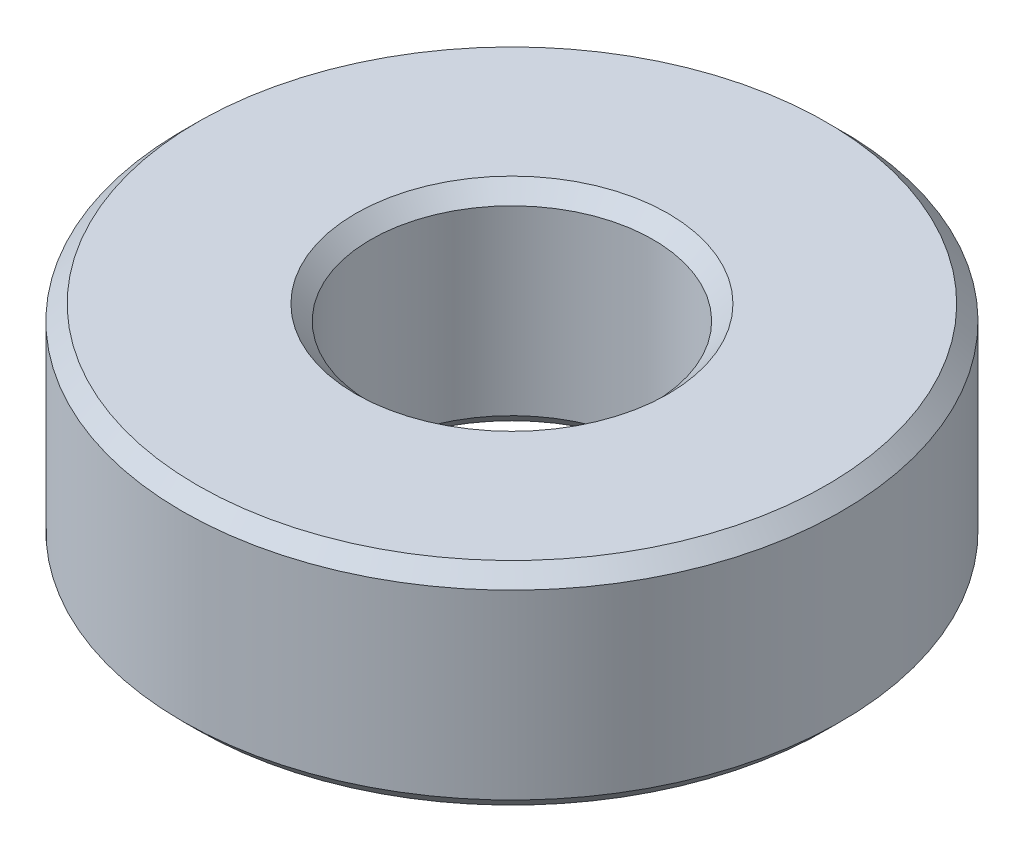
ISO-10303-21;
HEADER;
FILE_DESCRIPTION(('STEP AP214'),'2;1');
FILE_NAME('part.step','',(''),(''),'','','');
FILE_SCHEMA(('AUTOMOTIVE_DESIGN { 1 0 10303 214 1 1 1 1 }'));
ENDSEC;
DATA;
#1=APPLICATION_CONTEXT('core data for automotive mechanical design processes');
#2=APPLICATION_PROTOCOL_DEFINITION('international standard','automotive_design',2000,#1);
#3=PRODUCT_CONTEXT('',#1,'mechanical');
#4=PRODUCT('Part','Part','',(#3));
#5=PRODUCT_RELATED_PRODUCT_CATEGORY('part','',(#4));
#6=PRODUCT_DEFINITION_FORMATION('','',#4);
#7=PRODUCT_DEFINITION_CONTEXT('part definition',#1,'design');
#8=PRODUCT_DEFINITION('design','',#6,#7);
#9=PRODUCT_DEFINITION_SHAPE('','',#8);
#10=(LENGTH_UNIT() NAMED_UNIT(*) SI_UNIT(.MILLI.,.METRE.));
#11=(NAMED_UNIT(*) PLANE_ANGLE_UNIT() SI_UNIT($,.RADIAN.));
#12=(NAMED_UNIT(*) SI_UNIT($,.STERADIAN.) SOLID_ANGLE_UNIT());
#13=UNCERTAINTY_MEASURE_WITH_UNIT(LENGTH_MEASURE(1.E-05),#10,'distance_accuracy_value','');
#14=(GEOMETRIC_REPRESENTATION_CONTEXT(3) GLOBAL_UNCERTAINTY_ASSIGNED_CONTEXT((#13)) GLOBAL_UNIT_ASSIGNED_CONTEXT((#10,
#11,#12)) REPRESENTATION_CONTEXT('',''));
#15=CARTESIAN_POINT('',(0.,0.,0.));
#16=DIRECTION('',(0.,0.,1.));
#17=DIRECTION('',(1.,0.,0.));
#18=AXIS2_PLACEMENT_3D('',#15,#16,#17);
#19=CARTESIAN_POINT('',(0.,-3.571875,0.));
#20=DIRECTION('',(0.,1.,0.));
#21=DIRECTION('',(1.,0.,0.));
#22=AXIS2_PLACEMENT_3D('',#19,#20,#21);
#23=PLANE('',#22);
#24=CARTESIAN_POINT('',(0.,-3.571875,0.));
#25=DIRECTION('',(0.,1.,0.));
#26=DIRECTION('',(0.,0.,1.));
#27=AXIS2_PLACEMENT_3D('',#24,#25,#26);
#28=CIRCLE('',#27,5.2705);
#29=CARTESIAN_POINT('',(0.,-3.571875,5.2705));
#30=VERTEX_POINT('',#29);
#31=EDGE_CURVE('E10',#30,#30,#28,.T.);
#32=ORIENTED_EDGE('',*,*,#31,.T.);
#33=EDGE_LOOP('',(#32));
#34=FACE_BOUND('',#33,.T.);
#35=CARTESIAN_POINT('',(0.,-3.571875,0.));
#36=DIRECTION('',(0.,-1.,0.));
#37=DIRECTION('',(0.,0.,1.));
#38=AXIS2_PLACEMENT_3D('',#35,#36,#37);
#39=CIRCLE('',#38,10.6045);
#40=CARTESIAN_POINT('',(0.,-3.571875,10.6045));
#41=VERTEX_POINT('',#40);
#42=EDGE_CURVE('E34',#41,#41,#39,.T.);
#43=ORIENTED_EDGE('',*,*,#42,.T.);
#44=EDGE_LOOP('',(#43));
#45=FACE_BOUND('',#44,.T.);
#46=ADVANCED_FACE('F14',(#34,#45),#23,.F.);
#47=CARTESIAN_POINT('',(0.,3.571875,0.));
#48=DIRECTION('',(0.,1.,0.));
#49=DIRECTION('',(1.,0.,0.));
#50=AXIS2_PLACEMENT_3D('',#47,#48,#49);
#51=PLANE('',#50);
#52=CARTESIAN_POINT('',(0.,3.571875,0.));
#53=DIRECTION('',(0.,-1.,0.));
#54=DIRECTION('',(0.,0.,1.));
#55=AXIS2_PLACEMENT_3D('',#52,#53,#54);
#56=CIRCLE('',#55,5.2705);
#57=CARTESIAN_POINT('',(0.,3.571875,5.2705));
#58=VERTEX_POINT('',#57);
#59=EDGE_CURVE('E40',#58,#58,#56,.T.);
#60=ORIENTED_EDGE('',*,*,#59,.T.);
#61=EDGE_LOOP('',(#60));
#62=FACE_BOUND('',#61,.T.);
#63=CARTESIAN_POINT('',(0.,3.571875,0.));
#64=DIRECTION('',(0.,1.,0.));
#65=DIRECTION('',(0.,0.,1.));
#66=AXIS2_PLACEMENT_3D('',#63,#64,#65);
#67=CIRCLE('',#66,10.6045);
#68=CARTESIAN_POINT('',(0.,3.571875,10.6045));
#69=VERTEX_POINT('',#68);
#70=EDGE_CURVE('E57',#69,#69,#67,.T.);
#71=ORIENTED_EDGE('',*,*,#70,.T.);
#72=EDGE_LOOP('',(#71));
#73=FACE_BOUND('',#72,.T.);
#74=ADVANCED_FACE('F16',(#62,#73),#51,.T.);
#75=CARTESIAN_POINT('',(0.,3.571875,0.));
#76=DIRECTION('',(0.,-1.,0.));
#77=DIRECTION('',(0.,0.,-1.));
#78=AXIS2_PLACEMENT_3D('',#75,#76,#77);
#79=CYLINDRICAL_SURFACE('',#78,11.1125);
#80=CARTESIAN_POINT('',(0.,-3.063875,0.));
#81=DIRECTION('',(0.,1.,0.));
#82=DIRECTION('',(0.,0.,1.));
#83=AXIS2_PLACEMENT_3D('',#80,#81,#82);
#84=CIRCLE('',#83,11.1125);
#85=CARTESIAN_POINT('',(0.,-3.063875,11.1125));
#86=VERTEX_POINT('',#85);
#87=EDGE_CURVE('E18',#86,#86,#84,.T.);
#88=ORIENTED_EDGE('',*,*,#87,.T.);
#89=EDGE_LOOP('',(#88));
#90=FACE_BOUND('',#89,.T.);
#91=CARTESIAN_POINT('',(0.,3.063875,0.));
#92=DIRECTION('',(0.,-1.,0.));
#93=DIRECTION('',(0.,0.,1.));
#94=AXIS2_PLACEMENT_3D('',#91,#92,#93);
#95=CIRCLE('',#94,11.1125);
#96=CARTESIAN_POINT('',(0.,3.063875,11.1125));
#97=VERTEX_POINT('',#96);
#98=EDGE_CURVE('E47',#97,#97,#95,.T.);
#99=ORIENTED_EDGE('',*,*,#98,.T.);
#100=EDGE_LOOP('',(#99));
#101=FACE_BOUND('',#100,.T.);
#102=ADVANCED_FACE('F81',(#90,#101),#79,.T.);
#103=CARTESIAN_POINT('',(0.,3.571875,0.));
#104=DIRECTION('',(0.,-1.,0.));
#105=DIRECTION('',(0.,0.,-1.));
#106=AXIS2_PLACEMENT_3D('',#103,#104,#105);
#107=CYLINDRICAL_SURFACE('',#106,4.7625);
#108=CARTESIAN_POINT('',(0.,-3.063875,0.));
#109=DIRECTION('',(0.,-1.,0.));
#110=DIRECTION('',(0.,0.,1.));
#111=AXIS2_PLACEMENT_3D('',#108,#109,#110);
#112=CIRCLE('',#111,4.7625);
#113=CARTESIAN_POINT('',(0.,-3.063875,4.7625));
#114=VERTEX_POINT('',#113);
#115=EDGE_CURVE('E23',#114,#114,#112,.T.);
#116=ORIENTED_EDGE('',*,*,#115,.T.);
#117=EDGE_LOOP('',(#116));
#118=FACE_BOUND('',#117,.T.);
#119=CARTESIAN_POINT('',(0.,3.063875,0.));
#120=DIRECTION('',(0.,1.,0.));
#121=DIRECTION('',(0.,0.,1.));
#122=AXIS2_PLACEMENT_3D('',#119,#120,#121);
#123=CIRCLE('',#122,4.7625);
#124=CARTESIAN_POINT('',(0.,3.063875,4.7625));
#125=VERTEX_POINT('',#124);
#126=EDGE_CURVE('E37',#125,#125,#123,.T.);
#127=ORIENTED_EDGE('',*,*,#126,.T.);
#128=EDGE_LOOP('',(#127));
#129=FACE_BOUND('',#128,.T.);
#130=ADVANCED_FACE('F91',(#118,#129),#107,.F.);
#131=CARTESIAN_POINT('',(0.,-3.571875,0.));
#132=DIRECTION('',(0.,-1.,0.));
#133=DIRECTION('',(0.,0.,-1.));
#134=AXIS2_PLACEMENT_3D('',#131,#132,#133);
#135=CONICAL_SURFACE('',#134,5.2705,0.785398163397442);
#136=ORIENTED_EDGE('',*,*,#31,.F.);
#137=EDGE_LOOP('',(#136));
#138=FACE_BOUND('',#137,.T.);
#139=ORIENTED_EDGE('',*,*,#115,.F.);
#140=EDGE_LOOP('',(#139));
#141=FACE_BOUND('',#140,.T.);
#142=ADVANCED_FACE('F90',(#138,#141),#135,.F.);
#143=CARTESIAN_POINT('',(0.,-3.063875,0.));
#144=DIRECTION('',(0.,1.,0.));
#145=DIRECTION('',(0.,0.,1.));
#146=AXIS2_PLACEMENT_3D('',#143,#144,#145);
#147=CONICAL_SURFACE('',#146,11.1125,0.785398163397452);
#148=ORIENTED_EDGE('',*,*,#87,.F.);
#149=EDGE_LOOP('',(#148));
#150=FACE_BOUND('',#149,.T.);
#151=ORIENTED_EDGE('',*,*,#42,.F.);
#152=EDGE_LOOP('',(#151));
#153=FACE_BOUND('',#152,.T.);
#154=ADVANCED_FACE('F74',(#150,#153),#147,.T.);
#155=CARTESIAN_POINT('',(0.,3.063875,0.));
#156=DIRECTION('',(0.,1.,0.));
#157=DIRECTION('',(0.,0.,1.));
#158=AXIS2_PLACEMENT_3D('',#155,#156,#157);
#159=CONICAL_SURFACE('',#158,4.7625,0.785398163397452);
#160=ORIENTED_EDGE('',*,*,#59,.F.);
#161=EDGE_LOOP('',(#160));
#162=FACE_BOUND('',#161,.T.);
#163=ORIENTED_EDGE('',*,*,#126,.F.);
#164=EDGE_LOOP('',(#163));
#165=FACE_BOUND('',#164,.T.);
#166=ADVANCED_FACE('F68',(#162,#165),#159,.F.);
#167=CARTESIAN_POINT('',(0.,3.571875,0.));
#168=DIRECTION('',(0.,-1.,0.));
#169=DIRECTION('',(0.,0.,-1.));
#170=AXIS2_PLACEMENT_3D('',#167,#168,#169);
#171=CONICAL_SURFACE('',#170,10.6045,0.785398163397448);
#172=ORIENTED_EDGE('',*,*,#98,.F.);
#173=EDGE_LOOP('',(#172));
#174=FACE_BOUND('',#173,.T.);
#175=ORIENTED_EDGE('',*,*,#70,.F.);
#176=EDGE_LOOP('',(#175));
#177=FACE_BOUND('',#176,.T.);
#178=ADVANCED_FACE('F66',(#174,#177),#171,.T.);
#179=CLOSED_SHELL('',(#46,#74,#102,#130,#142,#154,#166,#178));
#180=MANIFOLD_SOLID_BREP('B1',#179);
#181=ADVANCED_BREP_SHAPE_REPRESENTATION('',(#18,#180),#14);
#182=SHAPE_DEFINITION_REPRESENTATION(#9,#181);
ENDSEC;
END-ISO-10303-21;
